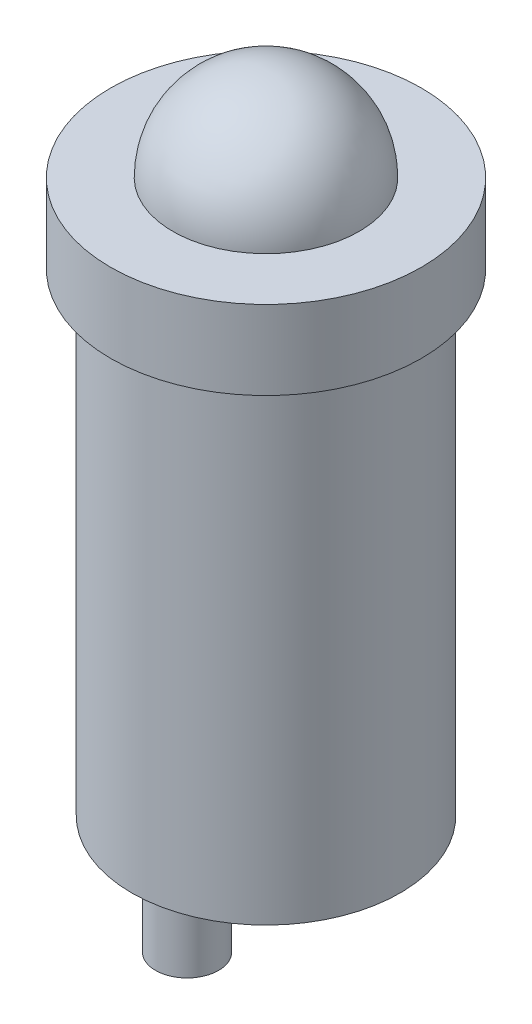
ISO-10303-21;
HEADER;
FILE_DESCRIPTION(('STEP AP214'),'2;1');
FILE_NAME('part.step','',(''),(''),'','','');
FILE_SCHEMA(('AUTOMOTIVE_DESIGN { 1 0 10303 214 1 1 1 1 }'));
ENDSEC;
DATA;
#1=APPLICATION_CONTEXT('core data for automotive mechanical design processes');
#2=APPLICATION_PROTOCOL_DEFINITION('international standard','automotive_design',2000,#1);
#3=PRODUCT_CONTEXT('',#1,'mechanical');
#4=PRODUCT('Part','Part','',(#3));
#5=PRODUCT_RELATED_PRODUCT_CATEGORY('part','',(#4));
#6=PRODUCT_DEFINITION_FORMATION('','',#4);
#7=PRODUCT_DEFINITION_CONTEXT('part definition',#1,'design');
#8=PRODUCT_DEFINITION('design','',#6,#7);
#9=PRODUCT_DEFINITION_SHAPE('','',#8);
#10=(LENGTH_UNIT() NAMED_UNIT(*) SI_UNIT(.MILLI.,.METRE.));
#11=(NAMED_UNIT(*) PLANE_ANGLE_UNIT() SI_UNIT($,.RADIAN.));
#12=(NAMED_UNIT(*) SI_UNIT($,.STERADIAN.) SOLID_ANGLE_UNIT());
#13=UNCERTAINTY_MEASURE_WITH_UNIT(LENGTH_MEASURE(1.E-05),#10,'distance_accuracy_value','');
#14=(GEOMETRIC_REPRESENTATION_CONTEXT(3) GLOBAL_UNCERTAINTY_ASSIGNED_CONTEXT((#13)) GLOBAL_UNIT_ASSIGNED_CONTEXT((#10,
#11,#12)) REPRESENTATION_CONTEXT('',''));
#15=CARTESIAN_POINT('',(0.,0.,0.));
#16=DIRECTION('',(0.,0.,1.));
#17=DIRECTION('',(1.,0.,0.));
#18=AXIS2_PLACEMENT_3D('',#15,#16,#17);
#19=CARTESIAN_POINT('',(0.,-1.27,-1.27));
#20=DIRECTION('',(0.,1.,0.));
#21=DIRECTION('',(0.,0.,1.));
#22=AXIS2_PLACEMENT_3D('',#19,#20,#21);
#23=CYLINDRICAL_SURFACE('',#22,0.508);
#24=CARTESIAN_POINT('',(0.,-1.27,-1.27));
#25=DIRECTION('',(0.,-1.,0.));
#26=DIRECTION('',(0.,0.,1.));
#27=AXIS2_PLACEMENT_3D('',#24,#25,#26);
#28=CIRCLE('',#27,0.508);
#29=CARTESIAN_POINT('',(0.,-1.27,-0.761999999999999));
#30=VERTEX_POINT('',#29);
#31=EDGE_CURVE('E11',#30,#30,#28,.T.);
#32=ORIENTED_EDGE('',*,*,#31,.F.);
#33=EDGE_LOOP('',(#32));
#34=FACE_BOUND('',#33,.T.);
#35=CARTESIAN_POINT('',(0.,0.,-1.27));
#36=DIRECTION('',(0.,-1.,0.));
#37=DIRECTION('',(0.,0.,1.));
#38=AXIS2_PLACEMENT_3D('',#35,#36,#37);
#39=CIRCLE('',#38,0.508);
#40=CARTESIAN_POINT('',(0.,0.,-0.761999999999999));
#41=VERTEX_POINT('',#40);
#42=EDGE_CURVE('E46',#41,#41,#39,.T.);
#43=ORIENTED_EDGE('',*,*,#42,.T.);
#44=EDGE_LOOP('',(#43));
#45=FACE_BOUND('',#44,.T.);
#46=ADVANCED_FACE('F43',(#34,#45),#23,.T.);
#47=CARTESIAN_POINT('',(0.,-1.27,-1.27));
#48=DIRECTION('',(0.,1.,0.));
#49=DIRECTION('',(0.,0.,1.));
#50=AXIS2_PLACEMENT_3D('',#47,#48,#49);
#51=PLANE('',#50);
#52=ORIENTED_EDGE('',*,*,#31,.T.);
#53=EDGE_LOOP('',(#52));
#54=FACE_BOUND('',#53,.T.);
#55=ADVANCED_FACE('F58',(#54),#51,.F.);
#56=CARTESIAN_POINT('',(0.,0.,-1.27));
#57=DIRECTION('',(0.,1.,0.));
#58=DIRECTION('',(0.,0.,1.));
#59=AXIS2_PLACEMENT_3D('',#56,#57,#58);
#60=PLANE('',#59);
#61=ORIENTED_EDGE('',*,*,#42,.F.);
#62=EDGE_LOOP('',(#61));
#63=FACE_BOUND('',#62,.T.);
#64=ADVANCED_FACE('F56',(#63),#60,.T.);
#65=CLOSED_SHELL('',(#46,#55,#64));
#66=MANIFOLD_SOLID_BREP('B2',#65);
#67=CARTESIAN_POINT('',(0.,-1.27,1.27));
#68=DIRECTION('',(0.,1.,0.));
#69=DIRECTION('',(0.,0.,1.));
#70=AXIS2_PLACEMENT_3D('',#67,#68,#69);
#71=CYLINDRICAL_SURFACE('',#70,0.508);
#72=CARTESIAN_POINT('',(0.,-1.27,1.27));
#73=DIRECTION('',(0.,-1.,0.));
#74=DIRECTION('',(0.,0.,-1.));
#75=AXIS2_PLACEMENT_3D('',#72,#73,#74);
#76=CIRCLE('',#75,0.508);
#77=CARTESIAN_POINT('',(0.,-1.27,0.761999999999999));
#78=VERTEX_POINT('',#77);
#79=EDGE_CURVE('E42',#78,#78,#76,.T.);
#80=ORIENTED_EDGE('',*,*,#79,.F.);
#81=EDGE_LOOP('',(#80));
#82=FACE_BOUND('',#81,.T.);
#83=CARTESIAN_POINT('',(0.,0.,1.27));
#84=DIRECTION('',(0.,-1.,0.));
#85=DIRECTION('',(0.,0.,-1.));
#86=AXIS2_PLACEMENT_3D('',#83,#84,#85);
#87=CIRCLE('',#86,0.508);
#88=CARTESIAN_POINT('',(0.,0.,0.761999999999999));
#89=VERTEX_POINT('',#88);
#90=EDGE_CURVE('E94',#89,#89,#87,.T.);
#91=ORIENTED_EDGE('',*,*,#90,.T.);
#92=EDGE_LOOP('',(#91));
#93=FACE_BOUND('',#92,.T.);
#94=ADVANCED_FACE('F91',(#82,#93),#71,.T.);
#95=CARTESIAN_POINT('',(0.,-1.27,1.27));
#96=DIRECTION('',(0.,-1.,0.));
#97=DIRECTION('',(0.,0.,-1.));
#98=AXIS2_PLACEMENT_3D('',#95,#96,#97);
#99=PLANE('',#98);
#100=ORIENTED_EDGE('',*,*,#79,.T.);
#101=EDGE_LOOP('',(#100));
#102=FACE_BOUND('',#101,.T.);
#103=ADVANCED_FACE('F106',(#102),#99,.T.);
#104=CARTESIAN_POINT('',(0.,0.,1.27));
#105=DIRECTION('',(0.,-1.,0.));
#106=DIRECTION('',(0.,0.,-1.));
#107=AXIS2_PLACEMENT_3D('',#104,#105,#106);
#108=PLANE('',#107);
#109=ORIENTED_EDGE('',*,*,#90,.F.);
#110=EDGE_LOOP('',(#109));
#111=FACE_BOUND('',#110,.T.);
#112=ADVANCED_FACE('F104',(#111),#108,.F.);
#113=CLOSED_SHELL('',(#94,#103,#112));
#114=MANIFOLD_SOLID_BREP('B6',#113);
#115=CARTESIAN_POINT('',(0.,8.89,0.));
#116=DIRECTION('',(-1.,0.,0.));
#117=DIRECTION('',(0.,0.,1.));
#118=AXIS2_PLACEMENT_3D('',#115,#116,#117);
#119=SPHERICAL_SURFACE('',#118,1.5);
#120=CARTESIAN_POINT('',(0.,8.89,0.));
#121=DIRECTION('',(0.,-1.,0.));
#122=DIRECTION('',(0.,0.,-1.));
#123=AXIS2_PLACEMENT_3D('',#120,#121,#122);
#124=SPHERICAL_SURFACE('',#123,1.5);
#125=CARTESIAN_POINT('',(0.,8.89,0.));
#126=DIRECTION('',(0.,-1.,0.));
#127=DIRECTION('',(0.,0.,-1.));
#128=AXIS2_PLACEMENT_3D('',#125,#126,#127);
#129=CIRCLE('',#128,1.5);
#130=CARTESIAN_POINT('',(0.,8.89000000000001,-1.5));
#131=VERTEX_POINT('',#130);
#132=EDGE_CURVE('E90',#131,#131,#129,.T.);
#133=ORIENTED_EDGE('',*,*,#132,.F.);
#134=EDGE_LOOP('',(#133));
#135=FACE_BOUND('',#134,.T.);
#136=ADVANCED_FACE('F138',(#135),#124,.T.);
#137=CARTESIAN_POINT('',(0.,8.89,0.));
#138=DIRECTION('',(0.,-1.,0.));
#139=DIRECTION('',(0.,0.,-1.));
#140=AXIS2_PLACEMENT_3D('',#137,#138,#139);
#141=PLANE('',#140);
#142=ORIENTED_EDGE('',*,*,#132,.T.);
#143=EDGE_LOOP('',(#142));
#144=FACE_BOUND('',#143,.T.);
#145=ADVANCED_FACE('F145',(#144),#141,.T.);
#146=CLOSED_SHELL('',(#136,#145));
#147=MANIFOLD_SOLID_BREP('B37',#146);
#148=CARTESIAN_POINT('',(0.,7.62,0.));
#149=DIRECTION('',(0.,-1.,0.));
#150=DIRECTION('',(0.,0.,-1.));
#151=AXIS2_PLACEMENT_3D('',#148,#149,#150);
#152=CYLINDRICAL_SURFACE('',#151,2.16);
#153=CARTESIAN_POINT('',(0.,7.62,0.));
#154=DIRECTION('',(0.,1.,0.));
#155=DIRECTION('',(0.,0.,1.));
#156=AXIS2_PLACEMENT_3D('',#153,#154,#155);
#157=CIRCLE('',#156,2.16);
#158=CARTESIAN_POINT('',(0.,7.62,2.16));
#159=VERTEX_POINT('',#158);
#160=EDGE_CURVE('E137',#159,#159,#157,.T.);
#161=ORIENTED_EDGE('',*,*,#160,.F.);
#162=EDGE_LOOP('',(#161));
#163=FACE_BOUND('',#162,.T.);
#164=CARTESIAN_POINT('',(0.,0.,0.));
#165=DIRECTION('',(0.,1.,0.));
#166=DIRECTION('',(0.,0.,1.));
#167=AXIS2_PLACEMENT_3D('',#164,#165,#166);
#168=CIRCLE('',#167,2.16);
#169=CARTESIAN_POINT('',(0.,0.,2.16));
#170=VERTEX_POINT('',#169);
#171=EDGE_CURVE('E169',#170,#170,#168,.T.);
#172=ORIENTED_EDGE('',*,*,#171,.T.);
#173=EDGE_LOOP('',(#172));
#174=FACE_BOUND('',#173,.T.);
#175=ADVANCED_FACE('F166',(#163,#174),#152,.T.);
#176=CARTESIAN_POINT('',(0.,0.,0.));
#177=DIRECTION('',(0.,1.,0.));
#178=DIRECTION('',(0.,0.,1.));
#179=AXIS2_PLACEMENT_3D('',#176,#177,#178);
#180=PLANE('',#179);
#181=ORIENTED_EDGE('',*,*,#171,.F.);
#182=EDGE_LOOP('',(#181));
#183=FACE_BOUND('',#182,.T.);
#184=ADVANCED_FACE('F189',(#183),#180,.F.);
#185=CARTESIAN_POINT('',(0.,8.89,0.));
#186=DIRECTION('',(0.,-1.,0.));
#187=DIRECTION('',(0.,0.,-1.));
#188=AXIS2_PLACEMENT_3D('',#185,#186,#187);
#189=CYLINDRICAL_SURFACE('',#188,2.5);
#190=CARTESIAN_POINT('',(0.,8.89,0.));
#191=DIRECTION('',(0.,1.,0.));
#192=DIRECTION('',(0.,0.,1.));
#193=AXIS2_PLACEMENT_3D('',#190,#191,#192);
#194=CIRCLE('',#193,2.5);
#195=CARTESIAN_POINT('',(0.,8.89,2.5));
#196=VERTEX_POINT('',#195);
#197=EDGE_CURVE('E176',#196,#196,#194,.T.);
#198=ORIENTED_EDGE('',*,*,#197,.F.);
#199=EDGE_LOOP('',(#198));
#200=FACE_BOUND('',#199,.T.);
#201=CARTESIAN_POINT('',(0.,7.62,0.));
#202=DIRECTION('',(0.,1.,0.));
#203=DIRECTION('',(0.,0.,1.));
#204=AXIS2_PLACEMENT_3D('',#201,#202,#203);
#205=CIRCLE('',#204,2.5);
#206=CARTESIAN_POINT('',(0.,7.62,2.5));
#207=VERTEX_POINT('',#206);
#208=EDGE_CURVE('E178',#207,#207,#205,.T.);
#209=ORIENTED_EDGE('',*,*,#208,.T.);
#210=EDGE_LOOP('',(#209));
#211=FACE_BOUND('',#210,.T.);
#212=ADVANCED_FACE('F186',(#200,#211),#189,.T.);
#213=CARTESIAN_POINT('',(0.,8.89,0.));
#214=DIRECTION('',(0.,1.,0.));
#215=DIRECTION('',(0.,0.,1.));
#216=AXIS2_PLACEMENT_3D('',#213,#214,#215);
#217=PLANE('',#216);
#218=ORIENTED_EDGE('',*,*,#197,.T.);
#219=EDGE_LOOP('',(#218));
#220=FACE_BOUND('',#219,.T.);
#221=ADVANCED_FACE('F184',(#220),#217,.T.);
#222=CARTESIAN_POINT('',(0.,7.62,0.));
#223=DIRECTION('',(0.,1.,0.));
#224=DIRECTION('',(0.,0.,1.));
#225=AXIS2_PLACEMENT_3D('',#222,#223,#224);
#226=PLANE('',#225);
#227=ORIENTED_EDGE('',*,*,#160,.T.);
#228=EDGE_LOOP('',(#227));
#229=FACE_BOUND('',#228,.T.);
#230=ORIENTED_EDGE('',*,*,#208,.F.);
#231=EDGE_LOOP('',(#230));
#232=FACE_BOUND('',#231,.T.);
#233=ADVANCED_FACE('F193',(#229,#232),#226,.F.);
#234=CLOSED_SHELL('',(#175,#184,#212,#221,#233));
#235=MANIFOLD_SOLID_BREP('B85',#234);
#236=ADVANCED_BREP_SHAPE_REPRESENTATION('',(#18,#66,#114,#147,#235),#14);
#237=SHAPE_DEFINITION_REPRESENTATION(#9,#236);
ENDSEC;
END-ISO-10303-21;
